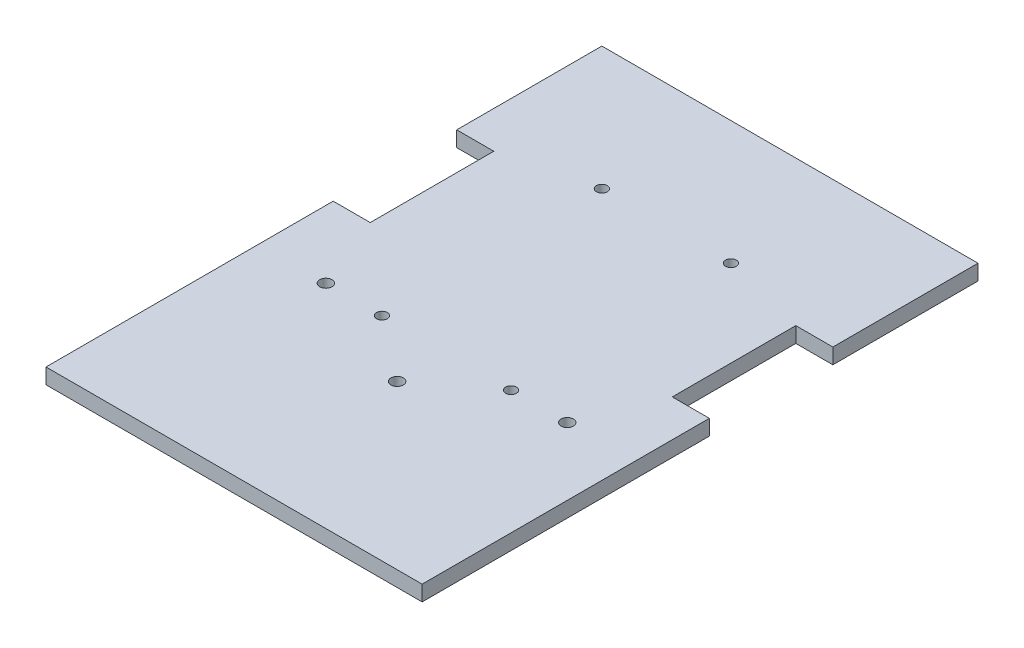
ISO-10303-21;
HEADER;
FILE_DESCRIPTION(('STEP AP214'),'2;1');
FILE_NAME('part.step','',(''),(''),'','','');
FILE_SCHEMA(('AUTOMOTIVE_DESIGN { 1 0 10303 214 1 1 1 1 }'));
ENDSEC;
DATA;
#1=APPLICATION_CONTEXT('core data for automotive mechanical design processes');
#2=APPLICATION_PROTOCOL_DEFINITION('international standard','automotive_design',2000,#1);
#3=PRODUCT_CONTEXT('',#1,'mechanical');
#4=PRODUCT('Part','Part','',(#3));
#5=PRODUCT_RELATED_PRODUCT_CATEGORY('part','',(#4));
#6=PRODUCT_DEFINITION_FORMATION('','',#4);
#7=PRODUCT_DEFINITION_CONTEXT('part definition',#1,'design');
#8=PRODUCT_DEFINITION('design','',#6,#7);
#9=PRODUCT_DEFINITION_SHAPE('','',#8);
#10=(LENGTH_UNIT() NAMED_UNIT(*) SI_UNIT(.MILLI.,.METRE.));
#11=(NAMED_UNIT(*) PLANE_ANGLE_UNIT() SI_UNIT($,.RADIAN.));
#12=(NAMED_UNIT(*) SI_UNIT($,.STERADIAN.) SOLID_ANGLE_UNIT());
#13=UNCERTAINTY_MEASURE_WITH_UNIT(LENGTH_MEASURE(1.E-05),#10,'distance_accuracy_value','');
#14=(GEOMETRIC_REPRESENTATION_CONTEXT(3) GLOBAL_UNCERTAINTY_ASSIGNED_CONTEXT((#13)) GLOBAL_UNIT_ASSIGNED_CONTEXT((#10,
#11,#12)) REPRESENTATION_CONTEXT('',''));
#15=CARTESIAN_POINT('',(0.,0.,0.));
#16=DIRECTION('',(0.,0.,1.));
#17=DIRECTION('',(1.,0.,0.));
#18=AXIS2_PLACEMENT_3D('',#15,#16,#17);
#19=CARTESIAN_POINT('',(-50.8,6.35,-141.244051327118));
#20=DIRECTION('',(1.,0.,0.));
#21=DIRECTION('',(0.,0.,-1.));
#22=AXIS2_PLACEMENT_3D('',#19,#20,#21);
#23=PLANE('',#22);
#24=DIRECTION('',(0.,0.,1.));
#25=VECTOR('',#24,1.);
#26=CARTESIAN_POINT('',(-50.8,0.,-141.244051327118));
#27=LINE('',#26,#25);
#28=CARTESIAN_POINT('',(-50.8,0.,-141.244051327118));
#29=VERTEX_POINT('',#28);
#30=CARTESIAN_POINT('',(-50.8,0.,-81.5540513271177));
#31=VERTEX_POINT('',#30);
#32=EDGE_CURVE('E151',#29,#31,#27,.T.);
#33=ORIENTED_EDGE('',*,*,#32,.T.);
#34=DIRECTION('',(0.,1.,0.));
#35=VECTOR('',#34,1.);
#36=CARTESIAN_POINT('',(-50.8,0.,-81.5540513271177));
#37=LINE('',#36,#35);
#38=CARTESIAN_POINT('',(-50.8,6.35,-81.5540513271177));
#39=VERTEX_POINT('',#38);
#40=EDGE_CURVE('E191',#31,#39,#37,.T.);
#41=ORIENTED_EDGE('',*,*,#40,.T.);
#42=DIRECTION('',(0.,0.,1.));
#43=VECTOR('',#42,1.);
#44=CARTESIAN_POINT('',(-50.8,6.35,-141.244051327118));
#45=LINE('',#44,#43);
#46=CARTESIAN_POINT('',(-50.8,6.35,-141.244051327118));
#47=VERTEX_POINT('',#46);
#48=EDGE_CURVE('E227',#47,#39,#45,.T.);
#49=ORIENTED_EDGE('',*,*,#48,.F.);
#50=DIRECTION('',(0.,-1.,0.));
#51=VECTOR('',#50,1.);
#52=CARTESIAN_POINT('',(-50.8,6.35,-141.244051327118));
#53=LINE('',#52,#51);
#54=EDGE_CURVE('E157',#47,#29,#53,.T.);
#55=ORIENTED_EDGE('',*,*,#54,.T.);
#56=EDGE_LOOP('',(#33,#41,#49,#55));
#57=FACE_BOUND('',#56,.T.);
#58=ADVANCED_FACE('F33',(#57),#23,.F.);
#59=CARTESIAN_POINT('',(103.886,6.35,-141.244051327118));
#60=DIRECTION('',(-1.,0.,0.));
#61=DIRECTION('',(0.,0.,1.));
#62=AXIS2_PLACEMENT_3D('',#59,#60,#61);
#63=PLANE('',#62);
#64=DIRECTION('',(0.,0.,-1.));
#65=VECTOR('',#64,1.);
#66=CARTESIAN_POINT('',(103.886,0.,-141.244051327118));
#67=LINE('',#66,#65);
#68=CARTESIAN_POINT('',(103.886,0.,87.3559486728823));
#69=VERTEX_POINT('',#68);
#70=CARTESIAN_POINT('',(103.886,0.,-30.7540513271177));
#71=VERTEX_POINT('',#70);
#72=EDGE_CURVE('E147',#69,#71,#67,.T.);
#73=ORIENTED_EDGE('',*,*,#72,.T.);
#74=DIRECTION('',(0.,1.,0.));
#75=VECTOR('',#74,1.);
#76=CARTESIAN_POINT('',(103.886,0.,-30.7540513271177));
#77=LINE('',#76,#75);
#78=CARTESIAN_POINT('',(103.886,6.35,-30.7540513271177));
#79=VERTEX_POINT('',#78);
#80=EDGE_CURVE('E208',#71,#79,#77,.T.);
#81=ORIENTED_EDGE('',*,*,#80,.T.);
#82=DIRECTION('',(0.,0.,-1.));
#83=VECTOR('',#82,1.);
#84=CARTESIAN_POINT('',(103.886,6.35,-141.244051327118));
#85=LINE('',#84,#83);
#86=CARTESIAN_POINT('',(103.886,6.35,87.3559486728823));
#87=VERTEX_POINT('',#86);
#88=EDGE_CURVE('E232',#87,#79,#85,.T.);
#89=ORIENTED_EDGE('',*,*,#88,.F.);
#90=DIRECTION('',(0.,-1.,0.));
#91=VECTOR('',#90,1.);
#92=CARTESIAN_POINT('',(103.886,6.35,87.3559486728823));
#93=LINE('',#92,#91);
#94=EDGE_CURVE('E42',#87,#69,#93,.T.);
#95=ORIENTED_EDGE('',*,*,#94,.T.);
#96=EDGE_LOOP('',(#73,#81,#89,#95));
#97=FACE_BOUND('',#96,.T.);
#98=ADVANCED_FACE('F325',(#97),#63,.F.);
#99=CARTESIAN_POINT('',(-50.8,6.35,-30.7540513271177));
#100=VERTEX_POINT('',#99);
#101=CARTESIAN_POINT('',(-50.8,6.35,87.3559486728823));
#102=VERTEX_POINT('',#101);
#103=EDGE_CURVE('E156',#100,#102,#45,.T.);
#104=ORIENTED_EDGE('',*,*,#103,.F.);
#105=DIRECTION('',(0.,1.,0.));
#106=VECTOR('',#105,1.);
#107=CARTESIAN_POINT('',(-50.8,0.,-30.7540513271177));
#108=LINE('',#107,#106);
#109=CARTESIAN_POINT('',(-50.8,0.,-30.7540513271177));
#110=VERTEX_POINT('',#109);
#111=EDGE_CURVE('E199',#110,#100,#108,.T.);
#112=ORIENTED_EDGE('',*,*,#111,.F.);
#113=CARTESIAN_POINT('',(-50.8,0.,87.3559486728823));
#114=VERTEX_POINT('',#113);
#115=EDGE_CURVE('E224',#110,#114,#27,.T.);
#116=ORIENTED_EDGE('',*,*,#115,.T.);
#117=DIRECTION('',(0.,-1.,0.));
#118=VECTOR('',#117,1.);
#119=CARTESIAN_POINT('',(-50.8,6.35,87.3559486728823));
#120=LINE('',#119,#118);
#121=EDGE_CURVE('E11',#102,#114,#120,.T.);
#122=ORIENTED_EDGE('',*,*,#121,.F.);
#123=EDGE_LOOP('',(#104,#112,#116,#122));
#124=FACE_BOUND('',#123,.T.);
#125=ADVANCED_FACE('F35',(#124),#23,.F.);
#126=CARTESIAN_POINT('',(-50.8,6.35,87.3559486728823));
#127=DIRECTION('',(0.,0.,-1.));
#128=DIRECTION('',(-1.,0.,0.));
#129=AXIS2_PLACEMENT_3D('',#126,#127,#128);
#130=PLANE('',#129);
#131=DIRECTION('',(1.,0.,0.));
#132=VECTOR('',#131,1.);
#133=CARTESIAN_POINT('',(-50.8,0.,87.3559486728823));
#134=LINE('',#133,#132);
#135=EDGE_CURVE('E148',#114,#69,#134,.T.);
#136=ORIENTED_EDGE('',*,*,#135,.T.);
#137=ORIENTED_EDGE('',*,*,#94,.F.);
#138=DIRECTION('',(1.,0.,0.));
#139=VECTOR('',#138,1.);
#140=CARTESIAN_POINT('',(-50.8,6.35,87.3559486728823));
#141=LINE('',#140,#139);
#142=EDGE_CURVE('E230',#102,#87,#141,.T.);
#143=ORIENTED_EDGE('',*,*,#142,.F.);
#144=ORIENTED_EDGE('',*,*,#121,.T.);
#145=EDGE_LOOP('',(#136,#137,#143,#144));
#146=FACE_BOUND('',#145,.T.);
#147=ADVANCED_FACE('F249',(#146),#130,.F.);
#148=CARTESIAN_POINT('',(103.886,6.35,-81.5540513271177));
#149=VERTEX_POINT('',#148);
#150=CARTESIAN_POINT('',(103.886,6.35,-141.244051327118));
#151=VERTEX_POINT('',#150);
#152=EDGE_CURVE('E140',#149,#151,#85,.T.);
#153=ORIENTED_EDGE('',*,*,#152,.F.);
#154=DIRECTION('',(0.,1.,0.));
#155=VECTOR('',#154,1.);
#156=CARTESIAN_POINT('',(103.886,0.,-81.5540513271177));
#157=LINE('',#156,#155);
#158=CARTESIAN_POINT('',(103.886,0.,-81.5540513271177));
#159=VERTEX_POINT('',#158);
#160=EDGE_CURVE('E127',#159,#149,#157,.T.);
#161=ORIENTED_EDGE('',*,*,#160,.F.);
#162=CARTESIAN_POINT('',(103.886,0.,-141.244051327118));
#163=VERTEX_POINT('',#162);
#164=EDGE_CURVE('E138',#159,#163,#67,.T.);
#165=ORIENTED_EDGE('',*,*,#164,.T.);
#166=DIRECTION('',(0.,-1.,0.));
#167=VECTOR('',#166,1.);
#168=CARTESIAN_POINT('',(103.886,6.35,-141.244051327118));
#169=LINE('',#168,#167);
#170=EDGE_CURVE('E160',#151,#163,#169,.T.);
#171=ORIENTED_EDGE('',*,*,#170,.F.);
#172=EDGE_LOOP('',(#153,#161,#165,#171));
#173=FACE_BOUND('',#172,.T.);
#174=ADVANCED_FACE('F136',(#173),#63,.F.);
#175=CARTESIAN_POINT('',(-50.8,6.35,-141.244051327118));
#176=DIRECTION('',(0.,0.,1.));
#177=DIRECTION('',(1.,0.,0.));
#178=AXIS2_PLACEMENT_3D('',#175,#176,#177);
#179=PLANE('',#178);
#180=DIRECTION('',(-1.,0.,0.));
#181=VECTOR('',#180,1.);
#182=CARTESIAN_POINT('',(-50.8,0.,-141.244051327118));
#183=LINE('',#182,#181);
#184=EDGE_CURVE('E146',#163,#29,#183,.T.);
#185=ORIENTED_EDGE('',*,*,#184,.T.);
#186=ORIENTED_EDGE('',*,*,#54,.F.);
#187=DIRECTION('',(-1.,0.,0.));
#188=VECTOR('',#187,1.);
#189=CARTESIAN_POINT('',(-50.8,6.35,-141.244051327118));
#190=LINE('',#189,#188);
#191=EDGE_CURVE('E161',#151,#47,#190,.T.);
#192=ORIENTED_EDGE('',*,*,#191,.F.);
#193=ORIENTED_EDGE('',*,*,#170,.T.);
#194=EDGE_LOOP('',(#185,#186,#192,#193));
#195=FACE_BOUND('',#194,.T.);
#196=ADVANCED_FACE('F288',(#195),#179,.F.);
#197=CARTESIAN_POINT('',(0.,6.35,0.));
#198=DIRECTION('',(0.,1.,0.));
#199=DIRECTION('',(0.,0.,1.));
#200=AXIS2_PLACEMENT_3D('',#197,#198,#199);
#201=PLANE('',#200);
#202=CARTESIAN_POINT('',(26.550112,6.35,20.29968));
#203=DIRECTION('',(0.,1.,0.));
#204=DIRECTION('',(0.,0.,1.));
#205=AXIS2_PLACEMENT_3D('',#202,#203,#204);
#206=CIRCLE('',#205,2.54);
#207=CARTESIAN_POINT('',(26.550112,6.35,22.83968));
#208=VERTEX_POINT('',#207);
#209=EDGE_CURVE('E168',#208,#208,#206,.T.);
#210=ORIENTED_EDGE('',*,*,#209,.F.);
#211=EDGE_LOOP('',(#210));
#212=FACE_BOUND('',#211,.T.);
#213=CARTESIAN_POINT('',(-23.0770828039394,6.35,-0.0203200000000042));
#214=DIRECTION('',(0.,1.,0.));
#215=DIRECTION('',(0.,0.,1.));
#216=AXIS2_PLACEMENT_3D('',#213,#214,#215);
#217=CIRCLE('',#216,2.54);
#218=CARTESIAN_POINT('',(-23.0770828039394,6.35,2.51968));
#219=VERTEX_POINT('',#218);
#220=EDGE_CURVE('E277',#219,#219,#217,.T.);
#221=ORIENTED_EDGE('',*,*,#220,.F.);
#222=EDGE_LOOP('',(#221));
#223=FACE_BOUND('',#222,.T.);
#224=CARTESIAN_POINT('',(76.1773068039394,6.35,-0.0203200000000042));
#225=DIRECTION('',(0.,1.,0.));
#226=DIRECTION('',(0.,0.,1.));
#227=AXIS2_PLACEMENT_3D('',#224,#225,#226);
#228=CIRCLE('',#227,2.54);
#229=CARTESIAN_POINT('',(76.1773068039394,6.35,2.51967999999999));
#230=VERTEX_POINT('',#229);
#231=EDGE_CURVE('E274',#230,#230,#228,.T.);
#232=ORIENTED_EDGE('',*,*,#231,.F.);
#233=EDGE_LOOP('',(#232));
#234=FACE_BOUND('',#233,.T.);
#235=DIRECTION('',(1.,0.,0.));
#236=VECTOR('',#235,1.);
#237=CARTESIAN_POINT('',(103.886,6.35,-30.7540513271177));
#238=LINE('',#237,#236);
#239=CARTESIAN_POINT('',(88.646,6.35,-30.7540513271177));
#240=VERTEX_POINT('',#239);
#241=EDGE_CURVE('E132',#240,#79,#238,.T.);
#242=ORIENTED_EDGE('',*,*,#241,.F.);
#243=DIRECTION('',(0.,0.,1.));
#244=VECTOR('',#243,1.);
#245=CARTESIAN_POINT('',(88.646,6.35,-81.5540513271177));
#246=LINE('',#245,#244);
#247=CARTESIAN_POINT('',(88.646,6.35,-81.5540513271177));
#248=VERTEX_POINT('',#247);
#249=EDGE_CURVE('E268',#248,#240,#246,.T.);
#250=ORIENTED_EDGE('',*,*,#249,.F.);
#251=DIRECTION('',(-1.,0.,0.));
#252=VECTOR('',#251,1.);
#253=CARTESIAN_POINT('',(103.886,6.35,-81.5540513271177));
#254=LINE('',#253,#252);
#255=EDGE_CURVE('E194',#149,#248,#254,.T.);
#256=ORIENTED_EDGE('',*,*,#255,.F.);
#257=ORIENTED_EDGE('',*,*,#152,.T.);
#258=ORIENTED_EDGE('',*,*,#191,.T.);
#259=ORIENTED_EDGE('',*,*,#48,.T.);
#260=DIRECTION('',(-1.,0.,0.));
#261=VECTOR('',#260,1.);
#262=CARTESIAN_POINT('',(-50.8,6.35,-81.5540513271177));
#263=LINE('',#262,#261);
#264=CARTESIAN_POINT('',(-35.56,6.35,-81.5540513271177));
#265=VERTEX_POINT('',#264);
#266=EDGE_CURVE('E183',#265,#39,#263,.T.);
#267=ORIENTED_EDGE('',*,*,#266,.F.);
#268=DIRECTION('',(0.,0.,-1.));
#269=VECTOR('',#268,1.);
#270=CARTESIAN_POINT('',(-35.56,6.35,-81.5540513271177));
#271=LINE('',#270,#269);
#272=CARTESIAN_POINT('',(-35.56,6.35,-30.7540513271177));
#273=VERTEX_POINT('',#272);
#274=EDGE_CURVE('E177',#273,#265,#271,.T.);
#275=ORIENTED_EDGE('',*,*,#274,.F.);
#276=DIRECTION('',(1.,0.,0.));
#277=VECTOR('',#276,1.);
#278=CARTESIAN_POINT('',(-50.8,6.35,-30.7540513271177));
#279=LINE('',#278,#277);
#280=EDGE_CURVE('E173',#100,#273,#279,.T.);
#281=ORIENTED_EDGE('',*,*,#280,.F.);
#282=ORIENTED_EDGE('',*,*,#103,.T.);
#283=ORIENTED_EDGE('',*,*,#142,.T.);
#284=ORIENTED_EDGE('',*,*,#88,.T.);
#285=EDGE_LOOP('',(#242,#250,#256,#257,#258,#259,#267,#275,#281,#282,#283,#284));
#286=FACE_BOUND('',#285,.T.);
#287=CARTESIAN_POINT('',(53.086,6.35,-90.4440513271177));
#288=DIRECTION('',(0.,1.,0.));
#289=DIRECTION('',(0.,0.,1.));
#290=AXIS2_PLACEMENT_3D('',#287,#288,#289);
#291=CIRCLE('',#290,2.2225);
#292=CARTESIAN_POINT('',(53.086,6.35,-88.2215513271177));
#293=VERTEX_POINT('',#292);
#294=EDGE_CURVE('E209',#293,#293,#291,.T.);
#295=ORIENTED_EDGE('',*,*,#294,.F.);
#296=EDGE_LOOP('',(#295));
#297=FACE_BOUND('',#296,.T.);
#298=CARTESIAN_POINT('',(0.,6.35,0.));
#299=DIRECTION('',(0.,1.,0.));
#300=DIRECTION('',(0.,0.,1.));
#301=AXIS2_PLACEMENT_3D('',#298,#299,#300);
#302=CIRCLE('',#301,2.2225);
#303=CARTESIAN_POINT('',(0.,6.35,2.2225));
#304=VERTEX_POINT('',#303);
#305=EDGE_CURVE('E216',#304,#304,#302,.T.);
#306=ORIENTED_EDGE('',*,*,#305,.F.);
#307=EDGE_LOOP('',(#306));
#308=FACE_BOUND('',#307,.T.);
#309=CARTESIAN_POINT('',(53.086,6.35,0.));
#310=DIRECTION('',(0.,1.,0.));
#311=DIRECTION('',(0.,0.,1.));
#312=AXIS2_PLACEMENT_3D('',#309,#310,#311);
#313=CIRCLE('',#312,2.2225);
#314=CARTESIAN_POINT('',(53.086,6.35,2.2225));
#315=VERTEX_POINT('',#314);
#316=EDGE_CURVE('E201',#315,#315,#313,.T.);
#317=ORIENTED_EDGE('',*,*,#316,.F.);
#318=EDGE_LOOP('',(#317));
#319=FACE_BOUND('',#318,.T.);
#320=CARTESIAN_POINT('',(0.,6.35,-90.4440513271177));
#321=DIRECTION('',(0.,1.,0.));
#322=DIRECTION('',(0.,0.,1.));
#323=AXIS2_PLACEMENT_3D('',#320,#321,#322);
#324=CIRCLE('',#323,2.2225);
#325=CARTESIAN_POINT('',(0.,6.35,-88.2215513271177));
#326=VERTEX_POINT('',#325);
#327=EDGE_CURVE('E221',#326,#326,#324,.T.);
#328=ORIENTED_EDGE('',*,*,#327,.F.);
#329=EDGE_LOOP('',(#328));
#330=FACE_BOUND('',#329,.T.);
#331=ADVANCED_FACE('F253',(#212,#223,#234,#286,#297,#308,#319,#330),#201,.T.);
#332=CARTESIAN_POINT('',(0.,0.,0.));
#333=DIRECTION('',(0.,1.,0.));
#334=DIRECTION('',(0.,0.,1.));
#335=AXIS2_PLACEMENT_3D('',#332,#333,#334);
#336=PLANE('',#335);
#337=CARTESIAN_POINT('',(26.550112,0.,20.29968));
#338=DIRECTION('',(0.,1.,0.));
#339=DIRECTION('',(0.,0.,1.));
#340=AXIS2_PLACEMENT_3D('',#337,#338,#339);
#341=CIRCLE('',#340,2.54);
#342=CARTESIAN_POINT('',(26.550112,0.,22.83968));
#343=VERTEX_POINT('',#342);
#344=EDGE_CURVE('E37',#343,#343,#341,.T.);
#345=ORIENTED_EDGE('',*,*,#344,.T.);
#346=EDGE_LOOP('',(#345));
#347=FACE_BOUND('',#346,.T.);
#348=CARTESIAN_POINT('',(-23.0770828039394,0.,-0.0203200000000042));
#349=DIRECTION('',(0.,1.,0.));
#350=DIRECTION('',(0.,0.,1.));
#351=AXIS2_PLACEMENT_3D('',#348,#349,#350);
#352=CIRCLE('',#351,2.54);
#353=CARTESIAN_POINT('',(-23.0770828039394,0.,2.51968));
#354=VERTEX_POINT('',#353);
#355=EDGE_CURVE('E167',#354,#354,#352,.T.);
#356=ORIENTED_EDGE('',*,*,#355,.T.);
#357=EDGE_LOOP('',(#356));
#358=FACE_BOUND('',#357,.T.);
#359=CARTESIAN_POINT('',(76.1773068039394,0.,-0.0203200000000042));
#360=DIRECTION('',(0.,1.,0.));
#361=DIRECTION('',(0.,0.,1.));
#362=AXIS2_PLACEMENT_3D('',#359,#360,#361);
#363=CIRCLE('',#362,2.54);
#364=CARTESIAN_POINT('',(76.1773068039394,0.,2.51967999999999));
#365=VERTEX_POINT('',#364);
#366=EDGE_CURVE('E165',#365,#365,#363,.T.);
#367=ORIENTED_EDGE('',*,*,#366,.T.);
#368=EDGE_LOOP('',(#367));
#369=FACE_BOUND('',#368,.T.);
#370=CARTESIAN_POINT('',(53.086,0.,-90.4440513271177));
#371=DIRECTION('',(0.,1.,0.));
#372=DIRECTION('',(0.,0.,1.));
#373=AXIS2_PLACEMENT_3D('',#370,#371,#372);
#374=CIRCLE('',#373,2.2225);
#375=CARTESIAN_POINT('',(53.086,0.,-88.2215513271177));
#376=VERTEX_POINT('',#375);
#377=EDGE_CURVE('E213',#376,#376,#374,.T.);
#378=ORIENTED_EDGE('',*,*,#377,.T.);
#379=EDGE_LOOP('',(#378));
#380=FACE_BOUND('',#379,.T.);
#381=CARTESIAN_POINT('',(0.,0.,0.));
#382=DIRECTION('',(0.,1.,0.));
#383=DIRECTION('',(0.,0.,1.));
#384=AXIS2_PLACEMENT_3D('',#381,#382,#383);
#385=CIRCLE('',#384,2.2225);
#386=CARTESIAN_POINT('',(0.,0.,2.2225));
#387=VERTEX_POINT('',#386);
#388=EDGE_CURVE('E204',#387,#387,#385,.T.);
#389=ORIENTED_EDGE('',*,*,#388,.T.);
#390=EDGE_LOOP('',(#389));
#391=FACE_BOUND('',#390,.T.);
#392=CARTESIAN_POINT('',(53.086,0.,0.));
#393=DIRECTION('',(0.,1.,0.));
#394=DIRECTION('',(0.,0.,1.));
#395=AXIS2_PLACEMENT_3D('',#392,#393,#394);
#396=CIRCLE('',#395,2.2225);
#397=CARTESIAN_POINT('',(53.086,0.,2.2225));
#398=VERTEX_POINT('',#397);
#399=EDGE_CURVE('E205',#398,#398,#396,.T.);
#400=ORIENTED_EDGE('',*,*,#399,.T.);
#401=EDGE_LOOP('',(#400));
#402=FACE_BOUND('',#401,.T.);
#403=CARTESIAN_POINT('',(0.,0.,-90.4440513271177));
#404=DIRECTION('',(0.,1.,0.));
#405=DIRECTION('',(0.,0.,1.));
#406=AXIS2_PLACEMENT_3D('',#403,#404,#405);
#407=CIRCLE('',#406,2.2225);
#408=CARTESIAN_POINT('',(0.,0.,-88.2215513271177));
#409=VERTEX_POINT('',#408);
#410=EDGE_CURVE('E212',#409,#409,#407,.T.);
#411=ORIENTED_EDGE('',*,*,#410,.T.);
#412=EDGE_LOOP('',(#411));
#413=FACE_BOUND('',#412,.T.);
#414=DIRECTION('',(0.,0.,1.));
#415=VECTOR('',#414,1.);
#416=CARTESIAN_POINT('',(88.646,0.,-81.5540513271177));
#417=LINE('',#416,#415);
#418=CARTESIAN_POINT('',(88.646,0.,-81.5540513271177));
#419=VERTEX_POINT('',#418);
#420=CARTESIAN_POINT('',(88.646,0.,-30.7540513271177));
#421=VERTEX_POINT('',#420);
#422=EDGE_CURVE('E50',#419,#421,#417,.T.);
#423=ORIENTED_EDGE('',*,*,#422,.T.);
#424=DIRECTION('',(1.,0.,0.));
#425=VECTOR('',#424,1.);
#426=CARTESIAN_POINT('',(103.886,0.,-30.7540513271177));
#427=LINE('',#426,#425);
#428=EDGE_CURVE('E141',#421,#71,#427,.T.);
#429=ORIENTED_EDGE('',*,*,#428,.T.);
#430=ORIENTED_EDGE('',*,*,#72,.F.);
#431=ORIENTED_EDGE('',*,*,#135,.F.);
#432=ORIENTED_EDGE('',*,*,#115,.F.);
#433=DIRECTION('',(1.,0.,0.));
#434=VECTOR('',#433,1.);
#435=CARTESIAN_POINT('',(-50.8,0.,-30.7540513271177));
#436=LINE('',#435,#434);
#437=CARTESIAN_POINT('',(-35.56,0.,-30.7540513271177));
#438=VERTEX_POINT('',#437);
#439=EDGE_CURVE('E190',#110,#438,#436,.T.);
#440=ORIENTED_EDGE('',*,*,#439,.T.);
#441=DIRECTION('',(0.,0.,-1.));
#442=VECTOR('',#441,1.);
#443=CARTESIAN_POINT('',(-35.56,0.,-81.5540513271177));
#444=LINE('',#443,#442);
#445=CARTESIAN_POINT('',(-35.56,0.,-81.5540513271177));
#446=VERTEX_POINT('',#445);
#447=EDGE_CURVE('E58',#438,#446,#444,.T.);
#448=ORIENTED_EDGE('',*,*,#447,.T.);
#449=DIRECTION('',(-1.,0.,0.));
#450=VECTOR('',#449,1.);
#451=CARTESIAN_POINT('',(-50.8,0.,-81.5540513271177));
#452=LINE('',#451,#450);
#453=EDGE_CURVE('E186',#446,#31,#452,.T.);
#454=ORIENTED_EDGE('',*,*,#453,.T.);
#455=ORIENTED_EDGE('',*,*,#32,.F.);
#456=ORIENTED_EDGE('',*,*,#184,.F.);
#457=ORIENTED_EDGE('',*,*,#164,.F.);
#458=DIRECTION('',(-1.,0.,0.));
#459=VECTOR('',#458,1.);
#460=CARTESIAN_POINT('',(103.886,0.,-81.5540513271177));
#461=LINE('',#460,#459);
#462=EDGE_CURVE('E123',#159,#419,#461,.T.);
#463=ORIENTED_EDGE('',*,*,#462,.T.);
#464=EDGE_LOOP('',(#423,#429,#430,#431,#432,#440,#448,#454,#455,#456,#457,#463));
#465=FACE_BOUND('',#464,.T.);
#466=ADVANCED_FACE('F144',(#347,#358,#369,#380,#391,#402,#413,#465),#336,.F.);
#467=CARTESIAN_POINT('',(0.,6.35,-90.4440513271177));
#468=DIRECTION('',(0.,-1.,0.));
#469=DIRECTION('',(0.,0.,-1.));
#470=AXIS2_PLACEMENT_3D('',#467,#468,#469);
#471=CYLINDRICAL_SURFACE('',#470,2.2225);
#472=ORIENTED_EDGE('',*,*,#327,.T.);
#473=EDGE_LOOP('',(#472));
#474=FACE_BOUND('',#473,.T.);
#475=ORIENTED_EDGE('',*,*,#410,.F.);
#476=EDGE_LOOP('',(#475));
#477=FACE_BOUND('',#476,.T.);
#478=ADVANCED_FACE('F303',(#474,#477),#471,.F.);
#479=CARTESIAN_POINT('',(53.086,6.35,0.));
#480=DIRECTION('',(0.,-1.,0.));
#481=DIRECTION('',(0.,0.,-1.));
#482=AXIS2_PLACEMENT_3D('',#479,#480,#481);
#483=CYLINDRICAL_SURFACE('',#482,2.2225);
#484=ORIENTED_EDGE('',*,*,#316,.T.);
#485=EDGE_LOOP('',(#484));
#486=FACE_BOUND('',#485,.T.);
#487=ORIENTED_EDGE('',*,*,#399,.F.);
#488=EDGE_LOOP('',(#487));
#489=FACE_BOUND('',#488,.T.);
#490=ADVANCED_FACE('F314',(#486,#489),#483,.F.);
#491=CARTESIAN_POINT('',(0.,6.35,0.));
#492=DIRECTION('',(0.,-1.,0.));
#493=DIRECTION('',(0.,0.,-1.));
#494=AXIS2_PLACEMENT_3D('',#491,#492,#493);
#495=CYLINDRICAL_SURFACE('',#494,2.2225);
#496=ORIENTED_EDGE('',*,*,#305,.T.);
#497=EDGE_LOOP('',(#496));
#498=FACE_BOUND('',#497,.T.);
#499=ORIENTED_EDGE('',*,*,#388,.F.);
#500=EDGE_LOOP('',(#499));
#501=FACE_BOUND('',#500,.T.);
#502=ADVANCED_FACE('F320',(#498,#501),#495,.F.);
#503=CARTESIAN_POINT('',(53.086,6.35,-90.4440513271177));
#504=DIRECTION('',(0.,-1.,0.));
#505=DIRECTION('',(0.,0.,-1.));
#506=AXIS2_PLACEMENT_3D('',#503,#504,#505);
#507=CYLINDRICAL_SURFACE('',#506,2.2225);
#508=ORIENTED_EDGE('',*,*,#294,.T.);
#509=EDGE_LOOP('',(#508));
#510=FACE_BOUND('',#509,.T.);
#511=ORIENTED_EDGE('',*,*,#377,.F.);
#512=EDGE_LOOP('',(#511));
#513=FACE_BOUND('',#512,.T.);
#514=ADVANCED_FACE('F367',(#510,#513),#507,.F.);
#515=CARTESIAN_POINT('',(-50.8,0.,-81.5540513271177));
#516=DIRECTION('',(0.,0.,-1.));
#517=DIRECTION('',(-1.,0.,0.));
#518=AXIS2_PLACEMENT_3D('',#515,#516,#517);
#519=PLANE('',#518);
#520=ORIENTED_EDGE('',*,*,#266,.T.);
#521=ORIENTED_EDGE('',*,*,#40,.F.);
#522=ORIENTED_EDGE('',*,*,#453,.F.);
#523=DIRECTION('',(0.,1.,0.));
#524=VECTOR('',#523,1.);
#525=CARTESIAN_POINT('',(-35.56,0.,-81.5540513271177));
#526=LINE('',#525,#524);
#527=EDGE_CURVE('E195',#446,#265,#526,.T.);
#528=ORIENTED_EDGE('',*,*,#527,.T.);
#529=EDGE_LOOP('',(#520,#521,#522,#528));
#530=FACE_BOUND('',#529,.T.);
#531=ADVANCED_FACE('F347',(#530),#519,.F.);
#532=CARTESIAN_POINT('',(-35.56,0.,-81.5540513271177));
#533=DIRECTION('',(1.,0.,0.));
#534=DIRECTION('',(0.,0.,-1.));
#535=AXIS2_PLACEMENT_3D('',#532,#533,#534);
#536=PLANE('',#535);
#537=ORIENTED_EDGE('',*,*,#274,.T.);
#538=ORIENTED_EDGE('',*,*,#527,.F.);
#539=ORIENTED_EDGE('',*,*,#447,.F.);
#540=DIRECTION('',(0.,1.,0.));
#541=VECTOR('',#540,1.);
#542=CARTESIAN_POINT('',(-35.56,0.,-30.7540513271177));
#543=LINE('',#542,#541);
#544=EDGE_CURVE('E197',#438,#273,#543,.T.);
#545=ORIENTED_EDGE('',*,*,#544,.T.);
#546=EDGE_LOOP('',(#537,#538,#539,#545));
#547=FACE_BOUND('',#546,.T.);
#548=ADVANCED_FACE('F256',(#547),#536,.F.);
#549=CARTESIAN_POINT('',(-50.8,0.,-30.7540513271177));
#550=DIRECTION('',(0.,0.,1.));
#551=DIRECTION('',(1.,0.,0.));
#552=AXIS2_PLACEMENT_3D('',#549,#550,#551);
#553=PLANE('',#552);
#554=ORIENTED_EDGE('',*,*,#280,.T.);
#555=ORIENTED_EDGE('',*,*,#544,.F.);
#556=ORIENTED_EDGE('',*,*,#439,.F.);
#557=ORIENTED_EDGE('',*,*,#111,.T.);
#558=EDGE_LOOP('',(#554,#555,#556,#557));
#559=FACE_BOUND('',#558,.T.);
#560=ADVANCED_FACE('F258',(#559),#553,.F.);
#561=CARTESIAN_POINT('',(103.886,0.,-30.7540513271177));
#562=DIRECTION('',(0.,0.,1.));
#563=DIRECTION('',(1.,0.,0.));
#564=AXIS2_PLACEMENT_3D('',#561,#562,#563);
#565=PLANE('',#564);
#566=ORIENTED_EDGE('',*,*,#241,.T.);
#567=ORIENTED_EDGE('',*,*,#80,.F.);
#568=ORIENTED_EDGE('',*,*,#428,.F.);
#569=DIRECTION('',(0.,1.,0.));
#570=VECTOR('',#569,1.);
#571=CARTESIAN_POINT('',(88.646,0.,-30.7540513271177));
#572=LINE('',#571,#570);
#573=EDGE_CURVE('E263',#421,#240,#572,.T.);
#574=ORIENTED_EDGE('',*,*,#573,.T.);
#575=EDGE_LOOP('',(#566,#567,#568,#574));
#576=FACE_BOUND('',#575,.T.);
#577=ADVANCED_FACE('F352',(#576),#565,.F.);
#578=CARTESIAN_POINT('',(88.646,0.,-81.5540513271177));
#579=DIRECTION('',(-1.,0.,0.));
#580=DIRECTION('',(0.,0.,1.));
#581=AXIS2_PLACEMENT_3D('',#578,#579,#580);
#582=PLANE('',#581);
#583=ORIENTED_EDGE('',*,*,#249,.T.);
#584=ORIENTED_EDGE('',*,*,#573,.F.);
#585=ORIENTED_EDGE('',*,*,#422,.F.);
#586=DIRECTION('',(0.,1.,0.));
#587=VECTOR('',#586,1.);
#588=CARTESIAN_POINT('',(88.646,0.,-81.5540513271177));
#589=LINE('',#588,#587);
#590=EDGE_CURVE('E129',#419,#248,#589,.T.);
#591=ORIENTED_EDGE('',*,*,#590,.T.);
#592=EDGE_LOOP('',(#583,#584,#585,#591));
#593=FACE_BOUND('',#592,.T.);
#594=ADVANCED_FACE('F349',(#593),#582,.F.);
#595=CARTESIAN_POINT('',(103.886,0.,-81.5540513271177));
#596=DIRECTION('',(0.,0.,-1.));
#597=DIRECTION('',(-1.,0.,0.));
#598=AXIS2_PLACEMENT_3D('',#595,#596,#597);
#599=PLANE('',#598);
#600=ORIENTED_EDGE('',*,*,#255,.T.);
#601=ORIENTED_EDGE('',*,*,#590,.F.);
#602=ORIENTED_EDGE('',*,*,#462,.F.);
#603=ORIENTED_EDGE('',*,*,#160,.T.);
#604=EDGE_LOOP('',(#600,#601,#602,#603));
#605=FACE_BOUND('',#604,.T.);
#606=ADVANCED_FACE('F126',(#605),#599,.F.);
#607=CARTESIAN_POINT('',(76.1773068039394,-11.43,-0.0203200000000042));
#608=DIRECTION('',(0.,1.,0.));
#609=DIRECTION('',(0.,0.,1.));
#610=AXIS2_PLACEMENT_3D('',#607,#608,#609);
#611=CYLINDRICAL_SURFACE('',#610,2.54);
#612=ORIENTED_EDGE('',*,*,#231,.T.);
#613=EDGE_LOOP('',(#612));
#614=FACE_BOUND('',#613,.T.);
#615=ORIENTED_EDGE('',*,*,#366,.F.);
#616=EDGE_LOOP('',(#615));
#617=FACE_BOUND('',#616,.T.);
#618=ADVANCED_FACE('F294',(#614,#617),#611,.F.);
#619=CARTESIAN_POINT('',(-23.0770828039394,-11.43,-0.0203200000000042));
#620=DIRECTION('',(0.,1.,0.));
#621=DIRECTION('',(0.,0.,1.));
#622=AXIS2_PLACEMENT_3D('',#619,#620,#621);
#623=CYLINDRICAL_SURFACE('',#622,2.54);
#624=ORIENTED_EDGE('',*,*,#220,.T.);
#625=EDGE_LOOP('',(#624));
#626=FACE_BOUND('',#625,.T.);
#627=ORIENTED_EDGE('',*,*,#355,.F.);
#628=EDGE_LOOP('',(#627));
#629=FACE_BOUND('',#628,.T.);
#630=ADVANCED_FACE('F297',(#626,#629),#623,.F.);
#631=CARTESIAN_POINT('',(26.550112,-11.43,20.29968));
#632=DIRECTION('',(0.,1.,0.));
#633=DIRECTION('',(0.,0.,1.));
#634=AXIS2_PLACEMENT_3D('',#631,#632,#633);
#635=CYLINDRICAL_SURFACE('',#634,2.54);
#636=ORIENTED_EDGE('',*,*,#209,.T.);
#637=EDGE_LOOP('',(#636));
#638=FACE_BOUND('',#637,.T.);
#639=ORIENTED_EDGE('',*,*,#344,.F.);
#640=EDGE_LOOP('',(#639));
#641=FACE_BOUND('',#640,.T.);
#642=ADVANCED_FACE('F283',(#638,#641),#635,.F.);
#643=CLOSED_SHELL('',(#58,#98,#125,#147,#174,#196,#331,#466,#478,#490,#502,#514,#531,#548,#560,
#577,#594,#606,#618,#630,#642));
#644=MANIFOLD_SOLID_BREP('B2',#643);
#645=ADVANCED_BREP_SHAPE_REPRESENTATION('',(#18,#644),#14);
#646=SHAPE_DEFINITION_REPRESENTATION(#9,#645);
ENDSEC;
END-ISO-10303-21;
